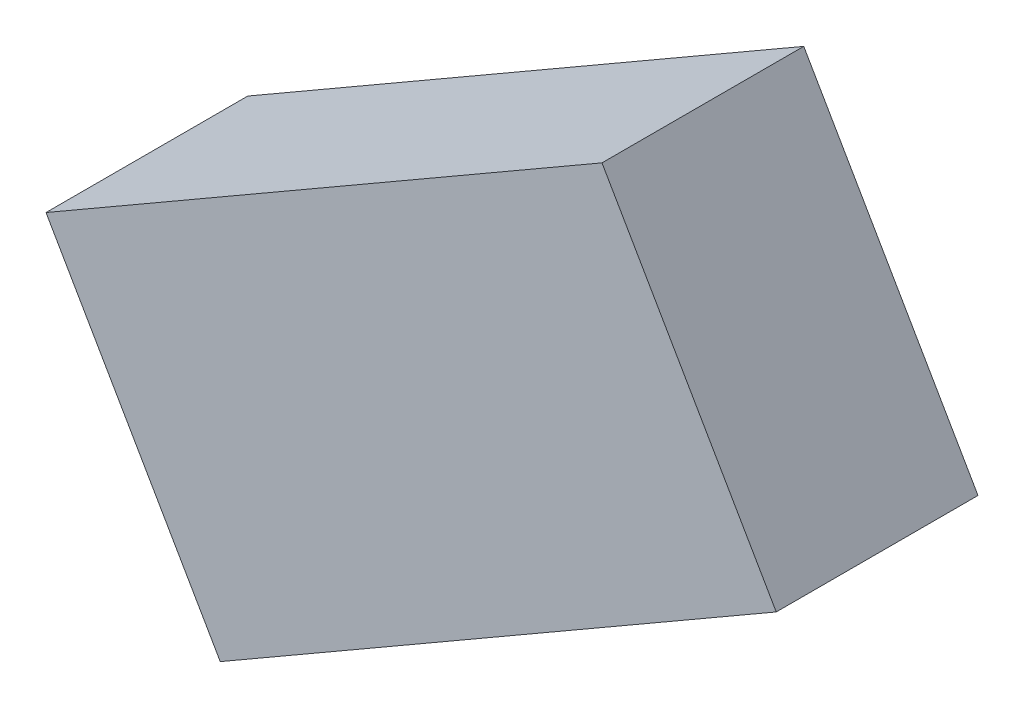
ISO-10303-21;
HEADER;
FILE_DESCRIPTION(('STEP AP214'),'2;1');
FILE_NAME('part.step','',(''),(''),'','','');
FILE_SCHEMA(('AUTOMOTIVE_DESIGN { 1 0 10303 214 1 1 1 1 }'));
ENDSEC;
DATA;
#1=APPLICATION_CONTEXT('core data for automotive mechanical design processes');
#2=APPLICATION_PROTOCOL_DEFINITION('international standard','automotive_design',2000,#1);
#3=PRODUCT_CONTEXT('',#1,'mechanical');
#4=PRODUCT('Part','Part','',(#3));
#5=PRODUCT_RELATED_PRODUCT_CATEGORY('part','',(#4));
#6=PRODUCT_DEFINITION_FORMATION('','',#4);
#7=PRODUCT_DEFINITION_CONTEXT('part definition',#1,'design');
#8=PRODUCT_DEFINITION('design','',#6,#7);
#9=PRODUCT_DEFINITION_SHAPE('','',#8);
#10=(LENGTH_UNIT() NAMED_UNIT(*) SI_UNIT(.MILLI.,.METRE.));
#11=(NAMED_UNIT(*) PLANE_ANGLE_UNIT() SI_UNIT($,.RADIAN.));
#12=(NAMED_UNIT(*) SI_UNIT($,.STERADIAN.) SOLID_ANGLE_UNIT());
#13=UNCERTAINTY_MEASURE_WITH_UNIT(LENGTH_MEASURE(1.E-05),#10,'distance_accuracy_value','');
#14=(GEOMETRIC_REPRESENTATION_CONTEXT(3) GLOBAL_UNCERTAINTY_ASSIGNED_CONTEXT((#13)) GLOBAL_UNIT_ASSIGNED_CONTEXT((#10,
#11,#12)) REPRESENTATION_CONTEXT('',''));
#15=CARTESIAN_POINT('',(0.,0.,0.));
#16=DIRECTION('',(0.,0.,1.));
#17=DIRECTION('',(1.,0.,0.));
#18=AXIS2_PLACEMENT_3D('',#15,#16,#17);
#19=CARTESIAN_POINT('',(-0.52027074,-0.84886038,0.5499989));
#20=DIRECTION('',(0.,0.,-1.));
#21=DIRECTION('',(-1.,0.,0.));
#22=AXIS2_PLACEMENT_3D('',#19,#20,#21);
#23=PLANE('',#22);
#24=DIRECTION('',(0.500002419059996,-0.866024007134994,0.));
#25=VECTOR('',#24,1.);
#26=CARTESIAN_POINT('',(0.9952736,0.02613914,0.5499989));
#27=LINE('',#26,#25);
#28=CARTESIAN_POINT('',(0.995273600000034,0.0261391399999409,0.5499989));
#29=VERTEX_POINT('',#28);
#30=CARTESIAN_POINT('',(0.520270739999913,0.84886291999995,0.5499989));
#31=VERTEX_POINT('',#30);
#32=EDGE_CURVE('E54',#29,#31,#27,.F.);
#33=ORIENTED_EDGE('',*,*,#32,.T.);
#34=DIRECTION('',(0.866024514547113,0.500001540201065,0.));
#35=VECTOR('',#34,1.);
#36=CARTESIAN_POINT('',(0.52027074,0.84886292,0.5499989));
#37=LINE('',#36,#35);
#38=CARTESIAN_POINT('',(-0.995271060000016,-0.0261391399999719,0.5499989));
#39=VERTEX_POINT('',#38);
#40=EDGE_CURVE('E56',#31,#39,#37,.F.);
#41=ORIENTED_EDGE('',*,*,#40,.T.);
#42=DIRECTION('',(-0.500001571544081,0.866024496451139,0.));
#43=VECTOR('',#42,1.);
#44=CARTESIAN_POINT('',(-0.99527106,-0.02613914,0.5499989));
#45=LINE('',#44,#43);
#46=CARTESIAN_POINT('',(-0.520270739999755,-0.848860379999859,0.5499989));
#47=VERTEX_POINT('',#46);
#48=EDGE_CURVE('E19',#39,#47,#45,.F.);
#49=ORIENTED_EDGE('',*,*,#48,.T.);
#50=DIRECTION('',(-0.866025505893321,-0.499999823142186,0.));
#51=VECTOR('',#50,1.);
#52=CARTESIAN_POINT('',(-0.52027074,-0.84886038,0.5499989));
#53=LINE('',#52,#51);
#54=EDGE_CURVE('E79',#47,#29,#53,.F.);
#55=ORIENTED_EDGE('',*,*,#54,.T.);
#56=EDGE_LOOP('',(#33,#41,#49,#55));
#57=FACE_BOUND('',#56,.T.);
#58=ADVANCED_FACE('F16',(#57),#23,.F.);
#59=CARTESIAN_POINT('',(-0.99527106,-0.02613914,0.));
#60=DIRECTION('',(0.866024496451139,0.500001571544081,0.));
#61=DIRECTION('',(-0.500001571544081,0.866024496451139,0.));
#62=AXIS2_PLACEMENT_3D('',#59,#60,#61);
#63=PLANE('',#62);
#64=DIRECTION('',(0.,0.,1.));
#65=VECTOR('',#64,1.);
#66=CARTESIAN_POINT('',(-0.52027074,-0.84886038,0.));
#67=LINE('',#66,#65);
#68=CARTESIAN_POINT('',(-0.520270739999755,-0.848860379999859,0.));
#69=VERTEX_POINT('',#68);
#70=EDGE_CURVE('E67',#69,#47,#67,.T.);
#71=ORIENTED_EDGE('',*,*,#70,.T.);
#72=ORIENTED_EDGE('',*,*,#48,.F.);
#73=DIRECTION('',(0.,0.,1.));
#74=VECTOR('',#73,1.);
#75=CARTESIAN_POINT('',(-0.995271060000065,-0.0261391399998881,0.));
#76=LINE('',#75,#74);
#77=CARTESIAN_POINT('',(-0.995271060000016,-0.026139139999972,0.));
#78=VERTEX_POINT('',#77);
#79=EDGE_CURVE('E62',#39,#78,#76,.F.);
#80=ORIENTED_EDGE('',*,*,#79,.T.);
#81=DIRECTION('',(-0.500001571543566,0.866024496451437,0.));
#82=VECTOR('',#81,1.);
#83=CARTESIAN_POINT('',(-0.52027074,-0.84886038,0.));
#84=LINE('',#83,#82);
#85=EDGE_CURVE('E82',#69,#78,#84,.T.);
#86=ORIENTED_EDGE('',*,*,#85,.F.);
#87=EDGE_LOOP('',(#71,#72,#80,#86));
#88=FACE_BOUND('',#87,.T.);
#89=ADVANCED_FACE('F64',(#88),#63,.F.);
#90=CARTESIAN_POINT('',(0.52027074,0.84886292,0.));
#91=DIRECTION('',(0.500001540201065,-0.866024514547113,0.));
#92=DIRECTION('',(0.866024514547113,0.500001540201065,0.));
#93=AXIS2_PLACEMENT_3D('',#90,#91,#92);
#94=PLANE('',#93);
#95=ORIENTED_EDGE('',*,*,#79,.F.);
#96=ORIENTED_EDGE('',*,*,#40,.F.);
#97=DIRECTION('',(0.,0.,1.));
#98=VECTOR('',#97,1.);
#99=CARTESIAN_POINT('',(0.520270739999652,0.848862919999799,0.));
#100=LINE('',#99,#98);
#101=CARTESIAN_POINT('',(0.520270739999913,0.84886291999995,0.));
#102=VERTEX_POINT('',#101);
#103=EDGE_CURVE('E74',#31,#102,#100,.F.);
#104=ORIENTED_EDGE('',*,*,#103,.T.);
#105=DIRECTION('',(0.866024514547076,0.500001540201129,0.));
#106=VECTOR('',#105,1.);
#107=CARTESIAN_POINT('',(-0.99527106,-0.02613914,0.));
#108=LINE('',#107,#106);
#109=EDGE_CURVE('E71',#78,#102,#108,.T.);
#110=ORIENTED_EDGE('',*,*,#109,.F.);
#111=EDGE_LOOP('',(#95,#96,#104,#110));
#112=FACE_BOUND('',#111,.T.);
#113=ADVANCED_FACE('F69',(#112),#94,.F.);
#114=CARTESIAN_POINT('',(0.9952736,0.02613914,0.));
#115=DIRECTION('',(-0.866024007134994,-0.500002419059996,0.));
#116=DIRECTION('',(0.500002419059996,-0.866024007134994,0.));
#117=AXIS2_PLACEMENT_3D('',#114,#115,#116);
#118=PLANE('',#117);
#119=ORIENTED_EDGE('',*,*,#103,.F.);
#120=ORIENTED_EDGE('',*,*,#32,.F.);
#121=DIRECTION('',(0.,0.,1.));
#122=VECTOR('',#121,1.);
#123=CARTESIAN_POINT('',(0.995273600000136,0.0261391399997636,0.));
#124=LINE('',#123,#122);
#125=CARTESIAN_POINT('',(0.995273600000034,0.0261391399999409,0.));
#126=VERTEX_POINT('',#125);
#127=EDGE_CURVE('E34',#29,#126,#124,.F.);
#128=ORIENTED_EDGE('',*,*,#127,.T.);
#129=DIRECTION('',(0.50000241905963,-0.866024007135205,0.));
#130=VECTOR('',#129,1.);
#131=CARTESIAN_POINT('',(0.52027074,0.84886292,0.));
#132=LINE('',#131,#130);
#133=EDGE_CURVE('E25',#102,#126,#132,.T.);
#134=ORIENTED_EDGE('',*,*,#133,.F.);
#135=EDGE_LOOP('',(#119,#120,#128,#134));
#136=FACE_BOUND('',#135,.T.);
#137=ADVANCED_FACE('F88',(#136),#118,.F.);
#138=CARTESIAN_POINT('',(-0.52027074,-0.84886038,0.));
#139=DIRECTION('',(-0.499999823142186,0.866025505893321,0.));
#140=DIRECTION('',(-0.866025505893321,-0.499999823142186,0.));
#141=AXIS2_PLACEMENT_3D('',#138,#139,#140);
#142=PLANE('',#141);
#143=ORIENTED_EDGE('',*,*,#127,.F.);
#144=ORIENTED_EDGE('',*,*,#54,.F.);
#145=ORIENTED_EDGE('',*,*,#70,.F.);
#146=DIRECTION('',(-0.866025505893243,-0.499999823142321,0.));
#147=VECTOR('',#146,1.);
#148=CARTESIAN_POINT('',(0.9952736,0.02613914,0.));
#149=LINE('',#148,#147);
#150=EDGE_CURVE('E11',#126,#69,#149,.T.);
#151=ORIENTED_EDGE('',*,*,#150,.F.);
#152=EDGE_LOOP('',(#143,#144,#145,#151));
#153=FACE_BOUND('',#152,.T.);
#154=ADVANCED_FACE('F90',(#153),#142,.F.);
#155=CARTESIAN_POINT('',(-0.52027074,-0.84886038,0.));
#156=DIRECTION('',(0.,0.,-1.));
#157=DIRECTION('',(-1.,0.,0.));
#158=AXIS2_PLACEMENT_3D('',#155,#156,#157);
#159=PLANE('',#158);
#160=ORIENTED_EDGE('',*,*,#133,.T.);
#161=ORIENTED_EDGE('',*,*,#150,.T.);
#162=ORIENTED_EDGE('',*,*,#85,.T.);
#163=ORIENTED_EDGE('',*,*,#109,.T.);
#164=EDGE_LOOP('',(#160,#161,#162,#163));
#165=FACE_BOUND('',#164,.T.);
#166=ADVANCED_FACE('F87',(#165),#159,.T.);
#167=CLOSED_SHELL('',(#58,#89,#113,#137,#154,#166));
#168=MANIFOLD_SOLID_BREP('B1',#167);
#169=ADVANCED_BREP_SHAPE_REPRESENTATION('',(#18,#168),#14);
#170=SHAPE_DEFINITION_REPRESENTATION(#9,#169);
ENDSEC;
END-ISO-10303-21;
